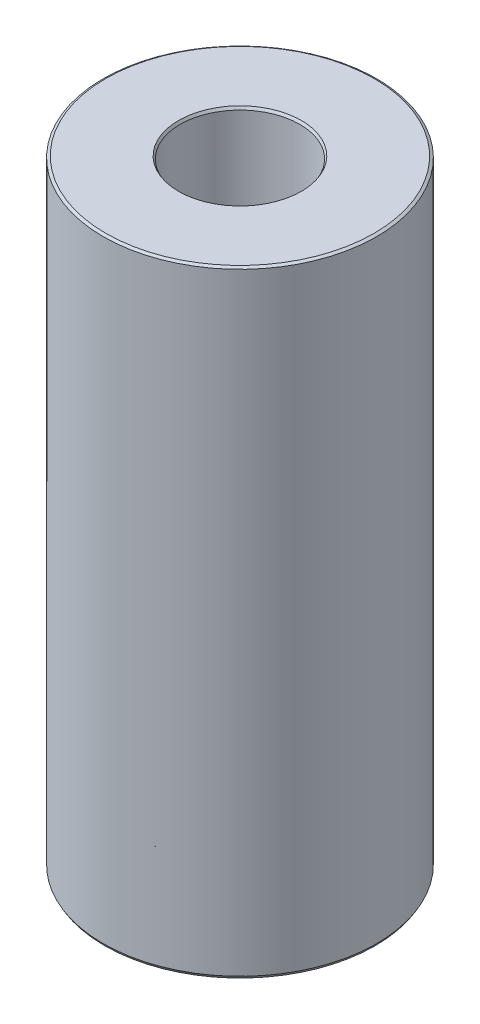
ISO-10303-21;
HEADER;
FILE_DESCRIPTION(('STEP AP214'),'2;1');
FILE_NAME('part.step','',(''),(''),'','','');
FILE_SCHEMA(('AUTOMOTIVE_DESIGN { 1 0 10303 214 1 1 1 1 }'));
ENDSEC;
DATA;
#1=APPLICATION_CONTEXT('core data for automotive mechanical design processes');
#2=APPLICATION_PROTOCOL_DEFINITION('international standard','automotive_design',2000,#1);
#3=PRODUCT_CONTEXT('',#1,'mechanical');
#4=PRODUCT('Part','Part','',(#3));
#5=PRODUCT_RELATED_PRODUCT_CATEGORY('part','',(#4));
#6=PRODUCT_DEFINITION_FORMATION('','',#4);
#7=PRODUCT_DEFINITION_CONTEXT('part definition',#1,'design');
#8=PRODUCT_DEFINITION('design','',#6,#7);
#9=PRODUCT_DEFINITION_SHAPE('','',#8);
#10=(LENGTH_UNIT() NAMED_UNIT(*) SI_UNIT(.MILLI.,.METRE.));
#11=(NAMED_UNIT(*) PLANE_ANGLE_UNIT() SI_UNIT($,.RADIAN.));
#12=(NAMED_UNIT(*) SI_UNIT($,.STERADIAN.) SOLID_ANGLE_UNIT());
#13=UNCERTAINTY_MEASURE_WITH_UNIT(LENGTH_MEASURE(1.E-05),#10,'distance_accuracy_value','');
#14=(GEOMETRIC_REPRESENTATION_CONTEXT(3) GLOBAL_UNCERTAINTY_ASSIGNED_CONTEXT((#13)) GLOBAL_UNIT_ASSIGNED_CONTEXT((#10,
#11,#12)) REPRESENTATION_CONTEXT('',''));
#15=CARTESIAN_POINT('',(0.,0.,0.));
#16=DIRECTION('',(0.,0.,1.));
#17=DIRECTION('',(1.,0.,0.));
#18=AXIS2_PLACEMENT_3D('',#15,#16,#17);
#19=CARTESIAN_POINT('',(0.,146.475468947492,0.));
#20=DIRECTION('',(0.,-1.,0.));
#21=DIRECTION('',(0.,0.,-1.));
#22=AXIS2_PLACEMENT_3D('',#19,#20,#21);
#23=CYLINDRICAL_SURFACE('',#22,32.5);
#24=CARTESIAN_POINT('',(0.,0.624573428641251,0.));
#25=DIRECTION('',(0.,1.,0.));
#26=DIRECTION('',(0.,0.,1.));
#27=AXIS2_PLACEMENT_3D('',#24,#25,#26);
#28=CIRCLE('',#27,32.5);
#29=CARTESIAN_POINT('',(0.,0.624573428641251,32.5));
#30=VERTEX_POINT('',#29);
#31=EDGE_CURVE('E10',#30,#30,#28,.T.);
#32=ORIENTED_EDGE('',*,*,#31,.T.);
#33=EDGE_LOOP('',(#32));
#34=FACE_BOUND('',#33,.T.);
#35=CARTESIAN_POINT('',(0.,146.114871310337,0.));
#36=DIRECTION('',(0.,1.,0.));
#37=DIRECTION('',(0.,0.,1.));
#38=AXIS2_PLACEMENT_3D('',#35,#36,#37);
#39=CIRCLE('',#38,32.5);
#40=CARTESIAN_POINT('',(0.,146.114871310337,32.5));
#41=VERTEX_POINT('',#40);
#42=EDGE_CURVE('E50',#41,#41,#39,.F.);
#43=ORIENTED_EDGE('',*,*,#42,.T.);
#44=EDGE_LOOP('',(#43));
#45=FACE_BOUND('',#44,.T.);
#46=ADVANCED_FACE('F39',(#34,#45),#23,.T.);
#47=CARTESIAN_POINT('',(0.,146.475468947492,0.));
#48=DIRECTION('',(0.,1.,0.));
#49=DIRECTION('',(0.,0.,1.));
#50=AXIS2_PLACEMENT_3D('',#47,#48,#49);
#51=PLANE('',#50);
#52=CARTESIAN_POINT('',(0.,146.475468947492,0.));
#53=DIRECTION('',(0.,1.,0.));
#54=DIRECTION('',(0.,0.,1.));
#55=AXIS2_PLACEMENT_3D('',#52,#53,#54);
#56=CIRCLE('',#55,14.5947774496918);
#57=CARTESIAN_POINT('',(0.,146.475468947492,14.5947774496918));
#58=VERTEX_POINT('',#57);
#59=EDGE_CURVE('E58',#58,#58,#56,.F.);
#60=ORIENTED_EDGE('',*,*,#59,.T.);
#61=EDGE_LOOP('',(#60));
#62=FACE_BOUND('',#61,.T.);
#63=CARTESIAN_POINT('',(0.,146.475468947492,0.));
#64=DIRECTION('',(0.,1.,0.));
#65=DIRECTION('',(0.,0.,1.));
#66=AXIS2_PLACEMENT_3D('',#63,#64,#65);
#67=CIRCLE('',#66,31.8754265713588);
#68=CARTESIAN_POINT('',(0.,146.475468947492,31.8754265713588));
#69=VERTEX_POINT('',#68);
#70=EDGE_CURVE('E61',#69,#69,#67,.T.);
#71=ORIENTED_EDGE('',*,*,#70,.T.);
#72=EDGE_LOOP('',(#71));
#73=FACE_BOUND('',#72,.T.);
#74=ADVANCED_FACE('F88',(#62,#73),#51,.T.);
#75=CARTESIAN_POINT('',(0.,0.,0.));
#76=DIRECTION('',(0.,1.,0.));
#77=DIRECTION('',(0.,0.,1.));
#78=AXIS2_PLACEMENT_3D('',#75,#76,#77);
#79=PLANE('',#78);
#80=CARTESIAN_POINT('',(0.,0.,0.));
#81=DIRECTION('',(0.,1.,0.));
#82=DIRECTION('',(0.,0.,1.));
#83=AXIS2_PLACEMENT_3D('',#80,#81,#82);
#84=CIRCLE('',#83,14.8587532411783);
#85=CARTESIAN_POINT('',(0.,0.,-14.8587532411783));
#86=VERTEX_POINT('',#85);
#87=EDGE_CURVE('E51',#86,#86,#84,.T.);
#88=ORIENTED_EDGE('',*,*,#87,.T.);
#89=EDGE_LOOP('',(#88));
#90=FACE_BOUND('',#89,.T.);
#91=CARTESIAN_POINT('',(0.,0.,0.));
#92=DIRECTION('',(0.,1.,0.));
#93=DIRECTION('',(0.,0.,1.));
#94=AXIS2_PLACEMENT_3D('',#91,#92,#93);
#95=CIRCLE('',#94,32.1394023628453);
#96=CARTESIAN_POINT('',(0.,0.,32.1394023628453));
#97=VERTEX_POINT('',#96);
#98=EDGE_CURVE('E54',#97,#97,#95,.F.);
#99=ORIENTED_EDGE('',*,*,#98,.T.);
#100=EDGE_LOOP('',(#99));
#101=FACE_BOUND('',#100,.T.);
#102=ADVANCED_FACE('F83',(#90,#101),#79,.F.);
#103=CARTESIAN_POINT('',(0.,146.475468947492,0.));
#104=DIRECTION('',(0.,-1.,0.));
#105=DIRECTION('',(0.,0.,-1.));
#106=AXIS2_PLACEMENT_3D('',#103,#104,#105);
#107=CYLINDRICAL_SURFACE('',#106,14.234179812537);
#108=CARTESIAN_POINT('',(0.,145.85089551885,0.));
#109=DIRECTION('',(0.,1.,0.));
#110=DIRECTION('',(0.,0.,1.));
#111=AXIS2_PLACEMENT_3D('',#108,#109,#110);
#112=CIRCLE('',#111,14.234179812537);
#113=CARTESIAN_POINT('',(0.,145.85089551885,-14.234179812537));
#114=VERTEX_POINT('',#113);
#115=EDGE_CURVE('E67',#114,#114,#112,.T.);
#116=CARTESIAN_POINT('',(0.,0.360597637154736,0.));
#117=DIRECTION('',(0.,1.,0.));
#118=DIRECTION('',(0.,0.,1.));
#119=AXIS2_PLACEMENT_3D('',#116,#117,#118);
#120=CIRCLE('',#119,14.234179812537);
#121=CARTESIAN_POINT('',(0.,0.360597637154736,-14.234179812537));
#122=VERTEX_POINT('',#121);
#123=EDGE_CURVE('E69',#122,#122,#120,.F.);
#124=CARTESIAN_POINT('',(0.,145.85089551885,-14.234179812537));
#125=CARTESIAN_POINT('',(0.,144.335371582583,-14.234179812537));
#126=CARTESIAN_POINT('',(0.,142.819847646315,-14.234179812537));
#127=CARTESIAN_POINT('',(0.,139.78879977378,-14.234179812537));
#128=CARTESIAN_POINT('',(0.,138.273275837512,-14.234179812537));
#129=CARTESIAN_POINT('',(0.,135.242227964977,-14.234179812537));
#130=CARTESIAN_POINT('',(0.,133.726704028709,-14.234179812537));
#131=CARTESIAN_POINT('',(0.,130.695656156174,-14.234179812537));
#132=CARTESIAN_POINT('',(0.,129.180132219906,-14.234179812537));
#133=CARTESIAN_POINT('',(0.,126.149084347371,-14.234179812537));
#134=CARTESIAN_POINT('',(0.,124.633560411103,-14.234179812537));
#135=CARTESIAN_POINT('',(0.,121.602512538568,-14.234179812537));
#136=CARTESIAN_POINT('',(0.,120.0869886023,-14.234179812537));
#137=CARTESIAN_POINT('',(0.,117.055940729765,-14.234179812537));
#138=CARTESIAN_POINT('',(0.,115.540416793497,-14.234179812537));
#139=CARTESIAN_POINT('',(0.,112.509368920962,-14.234179812537));
#140=CARTESIAN_POINT('',(0.,110.993844984694,-14.234179812537));
#141=CARTESIAN_POINT('',(0.,107.962797112159,-14.234179812537));
#142=CARTESIAN_POINT('',(0.,106.447273175891,-14.234179812537));
#143=CARTESIAN_POINT('',(0.,103.416225303356,-14.234179812537));
#144=CARTESIAN_POINT('',(0.,101.900701367088,-14.234179812537));
#145=CARTESIAN_POINT('',(0.,98.8696534945528,-14.234179812537));
#146=CARTESIAN_POINT('',(0.,97.3541295582851,-14.234179812537));
#147=CARTESIAN_POINT('',(0.,94.3230816857498,-14.234179812537));
#148=CARTESIAN_POINT('',(0.,92.8075577494821,-14.234179812537));
#149=CARTESIAN_POINT('',(0.,89.7765098769468,-14.234179812537));
#150=CARTESIAN_POINT('',(0.,88.2609859406791,-14.234179812537));
#151=CARTESIAN_POINT('',(0.,85.2299380681438,-14.234179812537));
#152=CARTESIAN_POINT('',(0.,83.7144141318762,-14.234179812537));
#153=CARTESIAN_POINT('',(0.,80.6833662593408,-14.234179812537));
#154=CARTESIAN_POINT('',(0.,79.1678423230732,-14.234179812537));
#155=CARTESIAN_POINT('',(0.,76.1367944505378,-14.234179812537));
#156=CARTESIAN_POINT('',(0.,74.6212705142702,-14.234179812537));
#157=CARTESIAN_POINT('',(0.,71.5902226417349,-14.234179812537));
#158=CARTESIAN_POINT('',(0.,70.0746987054672,-14.234179812537));
#159=CARTESIAN_POINT('',(0.,67.0436508329319,-14.234179812537));
#160=CARTESIAN_POINT('',(0.,65.5281268966642,-14.234179812537));
#161=CARTESIAN_POINT('',(0.,62.4970790241289,-14.234179812537));
#162=CARTESIAN_POINT('',(0.,60.9815550878612,-14.234179812537));
#163=CARTESIAN_POINT('',(0.,57.9505072153259,-14.234179812537));
#164=CARTESIAN_POINT('',(0.,56.4349832790582,-14.234179812537));
#165=CARTESIAN_POINT('',(0.,53.4039354065229,-14.234179812537));
#166=CARTESIAN_POINT('',(0.,51.8884114702553,-14.234179812537));
#167=CARTESIAN_POINT('',(0.,48.8573635977199,-14.234179812537));
#168=CARTESIAN_POINT('',(0.,47.3418396614523,-14.234179812537));
#169=CARTESIAN_POINT('',(0.,44.3107917889169,-14.234179812537));
#170=CARTESIAN_POINT('',(0.,42.7952678526493,-14.234179812537));
#171=CARTESIAN_POINT('',(0.,39.764219980114,-14.234179812537));
#172=CARTESIAN_POINT('',(0.,38.2486960438463,-14.234179812537));
#173=CARTESIAN_POINT('',(0.,35.217648171311,-14.234179812537));
#174=CARTESIAN_POINT('',(0.,33.7021242350433,-14.234179812537));
#175=CARTESIAN_POINT('',(0.,30.671076362508,-14.234179812537));
#176=CARTESIAN_POINT('',(0.,29.1555524262403,-14.234179812537));
#177=CARTESIAN_POINT('',(0.,26.124504553705,-14.234179812537));
#178=CARTESIAN_POINT('',(0.,24.6089806174373,-14.234179812537));
#179=CARTESIAN_POINT('',(0.,21.577932744902,-14.234179812537));
#180=CARTESIAN_POINT('',(0.,20.0624088086343,-14.234179812537));
#181=CARTESIAN_POINT('',(0.,17.031360936099,-14.234179812537));
#182=CARTESIAN_POINT('',(0.,15.5158369998314,-14.234179812537));
#183=CARTESIAN_POINT('',(0.,12.484789127296,-14.234179812537));
#184=CARTESIAN_POINT('',(0.,10.9692651910284,-14.234179812537));
#185=CARTESIAN_POINT('',(0.,7.93821731849307,-14.234179812537));
#186=CARTESIAN_POINT('',(0.,6.42269338222542,-14.234179812537));
#187=CARTESIAN_POINT('',(0.,3.39164550969008,-14.234179812537));
#188=CARTESIAN_POINT('',(0.,1.87612157342241,-14.234179812537));
#189=CARTESIAN_POINT('',(0.,0.360597637154736,-14.234179812537));
#190=B_SPLINE_CURVE_WITH_KNOTS('',3,(#124,#125,#126,#127,#128,#129,#130,#131,#132,#133,#134,
#135,#136,#137,#138,#139,#140,#141,#142,#143,#144,#145,#146,#147,#148,#149,#150,#151,#152,#153,
#154,#155,#156,#157,#158,#159,#160,#161,#162,#163,#164,#165,#166,#167,#168,#169,#170,#171,#172,
#173,#174,#175,#176,#177,#178,#179,#180,#181,#182,#183,#184,#185,#186,#187,#188,#189),
.UNSPECIFIED.,.F.,.F.,(4,2,2,2,2,2,2,2,2,2,2,2,2,2,2,2,2,2,2,2,2,2,2,2,2,2,2,2,2,2,2,2,4),(0.,
4.54657180880297,9.09314361760596,13.6397154264089,18.1862872352119,22.7328590440149,
27.2794308528179,31.8260026616209,36.3725744704239,40.9191462792269,45.4657180880299,
50.0122898968328,54.5588617056358,59.1054335144388,63.6520053232418,68.1985771320448,
72.7451489408478,77.2917207496507,81.8382925584537,86.3848643672567,90.9314361760597,
95.4780079848627,100.024579793666,104.571151602469,109.117723411272,113.664295220075,
118.210867028878,122.757438837681,127.304010646484,131.850582455287,136.39715426409,
140.943726072893,145.490297881696),.UNSPECIFIED.);
#191=EDGE_CURVE('BSEAM71',#114,#122,#190,.T.);
#192=ORIENTED_EDGE('',*,*,#115,.T.);
#193=ORIENTED_EDGE('',*,*,#123,.T.);
#194=ORIENTED_EDGE('',*,*,#191,.T.);
#195=ORIENTED_EDGE('',*,*,#191,.F.);
#196=EDGE_LOOP('',(#192,#194,#193,#195));
#197=FACE_BOUND('',#196,.T.);
#198=ADVANCED_FACE('F71',(#197),#107,.F.);
#199=CARTESIAN_POINT('',(0.,145.85089551885,0.));
#200=DIRECTION('',(0.,1.,0.));
#201=DIRECTION('',(0.,0.,1.));
#202=AXIS2_PLACEMENT_3D('',#199,#200,#201);
#203=CONICAL_SURFACE('',#202,14.234179812537,0.523598775598322);
#204=ORIENTED_EDGE('',*,*,#59,.F.);
#205=EDGE_LOOP('',(#204));
#206=FACE_BOUND('',#205,.T.);
#207=ORIENTED_EDGE('',*,*,#115,.F.);
#208=EDGE_LOOP('',(#207));
#209=FACE_BOUND('',#208,.T.);
#210=ADVANCED_FACE('F77',(#206,#209),#203,.F.);
#211=CARTESIAN_POINT('',(0.,0.,0.));
#212=DIRECTION('',(0.,-1.,0.));
#213=DIRECTION('',(0.,0.,-1.));
#214=AXIS2_PLACEMENT_3D('',#211,#212,#213);
#215=CONICAL_SURFACE('',#214,14.8587532411783,1.04719755119659);
#216=CARTESIAN_POINT('',(0.,0.360597637154736,-14.234179812537));
#217=CARTESIAN_POINT('',(0.,0.356841411767708,-14.240685785752));
#218=CARTESIAN_POINT('',(0.,0.353085186380679,-14.247191758967));
#219=CARTESIAN_POINT('',(0.,0.345572735606622,-14.2602037053971));
#220=CARTESIAN_POINT('',(0.,0.341816510219593,-14.2667096786121));
#221=CARTESIAN_POINT('',(0.,0.334304059445536,-14.2797216250421));
#222=CARTESIAN_POINT('',(0.,0.330547834058508,-14.2862275982571));
#223=CARTESIAN_POINT('',(0.,0.323035383284451,-14.2992395446872));
#224=CARTESIAN_POINT('',(0.,0.319279157897422,-14.3057455179022));
#225=CARTESIAN_POINT('',(0.,0.311766707123365,-14.3187574643322));
#226=CARTESIAN_POINT('',(0.,0.308010481736337,-14.3252634375472));
#227=CARTESIAN_POINT('',(0.,0.30049803096228,-14.3382753839772));
#228=CARTESIAN_POINT('',(0.,0.296741805575251,-14.3447813571922));
#229=CARTESIAN_POINT('',(0.,0.289229354801194,-14.3577933036223));
#230=CARTESIAN_POINT('',(0.,0.285473129414166,-14.3642992768373));
#231=CARTESIAN_POINT('',(0.,0.277960678640109,-14.3773112232673));
#232=CARTESIAN_POINT('',(0.,0.27420445325308,-14.3838171964823));
#233=CARTESIAN_POINT('',(0.,0.266692002479023,-14.3968291429124));
#234=CARTESIAN_POINT('',(0.,0.262935777091995,-14.4033351161274));
#235=CARTESIAN_POINT('',(0.,0.255423326317938,-14.4163470625574));
#236=CARTESIAN_POINT('',(0.,0.25166710093091,-14.4228530357724));
#237=CARTESIAN_POINT('',(0.,0.244154650156852,-14.4358649822024));
#238=CARTESIAN_POINT('',(0.,0.240398424769824,-14.4423709554174));
#239=CARTESIAN_POINT('',(0.,0.232885973995767,-14.4553829018475));
#240=CARTESIAN_POINT('',(0.,0.229129748608739,-14.4618888750625));
#241=CARTESIAN_POINT('',(0.,0.221617297834682,-14.4749008214925));
#242=CARTESIAN_POINT('',(0.,0.217861072447653,-14.4814067947075));
#243=CARTESIAN_POINT('',(0.,0.210348621673596,-14.4944187411376));
#244=CARTESIAN_POINT('',(0.,0.206592396286568,-14.5009247143526));
#245=CARTESIAN_POINT('',(0.,0.199079945512511,-14.5139366607826));
#246=CARTESIAN_POINT('',(0.,0.195323720125482,-14.5204426339976));
#247=CARTESIAN_POINT('',(0.,0.187811269351425,-14.5334545804276));
#248=CARTESIAN_POINT('',(0.,0.184055043964396,-14.5399605536426));
#249=CARTESIAN_POINT('',(0.,0.17654259319034,-14.5529725000727));
#250=CARTESIAN_POINT('',(0.,0.172786367803311,-14.5594784732877));
#251=CARTESIAN_POINT('',(0.,0.165273917029254,-14.5724904197177));
#252=CARTESIAN_POINT('',(0.,0.161517691642225,-14.5789963929327));
#253=CARTESIAN_POINT('',(0.,0.154005240868168,-14.5920083393628));
#254=CARTESIAN_POINT('',(0.,0.15024901548114,-14.5985143125778));
#255=CARTESIAN_POINT('',(0.,0.142736564707083,-14.6115262590078));
#256=CARTESIAN_POINT('',(0.,0.138980339320054,-14.6180322322228));
#257=CARTESIAN_POINT('',(0.,0.131467888545997,-14.6310441786528));
#258=CARTESIAN_POINT('',(0.,0.127711663158969,-14.6375501518678));
#259=CARTESIAN_POINT('',(0.,0.120199212384912,-14.6505620982979));
#260=CARTESIAN_POINT('',(0.,0.116442986997883,-14.6570680715129));
#261=CARTESIAN_POINT('',(0.,0.108930536223826,-14.6700800179429));
#262=CARTESIAN_POINT('',(0.,0.105174310836798,-14.6765859911579));
#263=CARTESIAN_POINT('',(0.,0.0976618600627411,-14.689597937588));
#264=CARTESIAN_POINT('',(0.,0.0939056346757127,-14.696103910803));
#265=CARTESIAN_POINT('',(0.,0.0863931839016555,-14.709115857233));
#266=CARTESIAN_POINT('',(0.,0.0826369585146268,-14.715621830448));
#267=CARTESIAN_POINT('',(0.,0.0751245077405698,-14.728633776878));
#268=CARTESIAN_POINT('',(0.,0.0713682823535416,-14.735139750093));
#269=CARTESIAN_POINT('',(0.,0.0638558315794846,-14.7481516965231));
#270=CARTESIAN_POINT('',(0.,0.0600996061924558,-14.7546576697381));
#271=CARTESIAN_POINT('',(0.,0.0525871554183989,-14.7676696161681));
#272=CARTESIAN_POINT('',(0.,0.0488309300313706,-14.7741755893831));
#273=CARTESIAN_POINT('',(0.,0.0413184792573136,-14.7871875358132));
#274=CARTESIAN_POINT('',(0.,0.0375622538702849,-14.7936935090282));
#275=CARTESIAN_POINT('',(0.,0.0300498030962279,-14.8067054554582));
#276=CARTESIAN_POINT('',(0.,0.0262935777091996,-14.8132114286732));
#277=CARTESIAN_POINT('',(0.,0.0187811269351427,-14.8262233751032));
#278=CARTESIAN_POINT('',(0.,0.015024901548114,-14.8327293483182));
#279=CARTESIAN_POINT('',(0.,0.00751245077405673,-14.8457412947483));
#280=CARTESIAN_POINT('',(0.,0.00375622538702809,-14.8522472679633));
#281=CARTESIAN_POINT('',(0.,0.,-14.8587532411783));
#282=B_SPLINE_CURVE_WITH_KNOTS('',3,(#216,#217,#218,#219,#220,#221,#222,#223,#224,#225,#226,
#227,#228,#229,#230,#231,#232,#233,#234,#235,#236,#237,#238,#239,#240,#241,#242,#243,#244,#245,
#246,#247,#248,#249,#250,#251,#252,#253,#254,#255,#256,#257,#258,#259,#260,#261,#262,#263,#264,
#265,#266,#267,#268,#269,#270,#271,#272,#273,#274,#275,#276,#277,#278,#279,#280,#281),
.UNSPECIFIED.,.F.,.F.,(4,2,2,2,2,2,2,2,2,2,2,2,2,2,2,2,2,2,2,2,2,2,2,2,2,2,2,2,2,2,2,2,4),(0.,
0.0225373523221715,0.0450747046443414,0.0676120569665129,0.0901494092886828,0.112686761610854,
0.135224113933024,0.157761466255196,0.180298818577366,0.202836170899537,0.225373523221709,
0.247910875543878,0.27044822786605,0.29298558018822,0.315522932510391,0.338060284832561,
0.360597637154733,0.383134989476904,0.405672341799074,0.428209694121245,0.450747046443415,
0.473284398765587,0.495821751087757,0.518359103409928,0.5408964557321,0.56343380805427,
0.585971160376441,0.608508512698611,0.631045865020782,0.653583217342952,0.676120569665124,
0.698657921987294,0.721195274309465),.UNSPECIFIED.);
#283=EDGE_CURVE('BSEAM73',#122,#86,#282,.T.);
#284=ORIENTED_EDGE('',*,*,#123,.F.);
#285=ORIENTED_EDGE('',*,*,#87,.F.);
#286=ORIENTED_EDGE('',*,*,#283,.T.);
#287=ORIENTED_EDGE('',*,*,#283,.F.);
#288=EDGE_LOOP('',(#284,#286,#285,#287));
#289=FACE_BOUND('',#288,.T.);
#290=ADVANCED_FACE('F73',(#289),#215,.F.);
#291=CARTESIAN_POINT('',(0.,0.624573428641251,0.));
#292=DIRECTION('',(0.,1.,0.));
#293=DIRECTION('',(0.,0.,1.));
#294=AXIS2_PLACEMENT_3D('',#291,#292,#293);
#295=CONICAL_SURFACE('',#294,32.5,0.523598775598292);
#296=ORIENTED_EDGE('',*,*,#98,.F.);
#297=EDGE_LOOP('',(#296));
#298=FACE_BOUND('',#297,.T.);
#299=ORIENTED_EDGE('',*,*,#31,.F.);
#300=EDGE_LOOP('',(#299));
#301=FACE_BOUND('',#300,.T.);
#302=ADVANCED_FACE('F76',(#298,#301),#295,.T.);
#303=CARTESIAN_POINT('',(0.,146.475468947492,0.));
#304=DIRECTION('',(0.,-1.,0.));
#305=DIRECTION('',(0.,0.,-1.));
#306=AXIS2_PLACEMENT_3D('',#303,#304,#305);
#307=CONICAL_SURFACE('',#306,31.8754265713588,1.0471975511966);
#308=ORIENTED_EDGE('',*,*,#42,.F.);
#309=EDGE_LOOP('',(#308));
#310=FACE_BOUND('',#309,.T.);
#311=ORIENTED_EDGE('',*,*,#70,.F.);
#312=EDGE_LOOP('',(#311));
#313=FACE_BOUND('',#312,.T.);
#314=ADVANCED_FACE('F45',(#310,#313),#307,.T.);
#315=CLOSED_SHELL('',(#46,#74,#102,#198,#210,#290,#302,#314));
#316=MANIFOLD_SOLID_BREP('B2',#315);
#317=ADVANCED_BREP_SHAPE_REPRESENTATION('',(#18,#316),#14);
#318=SHAPE_DEFINITION_REPRESENTATION(#9,#317);
ENDSEC;
END-ISO-10303-21;
